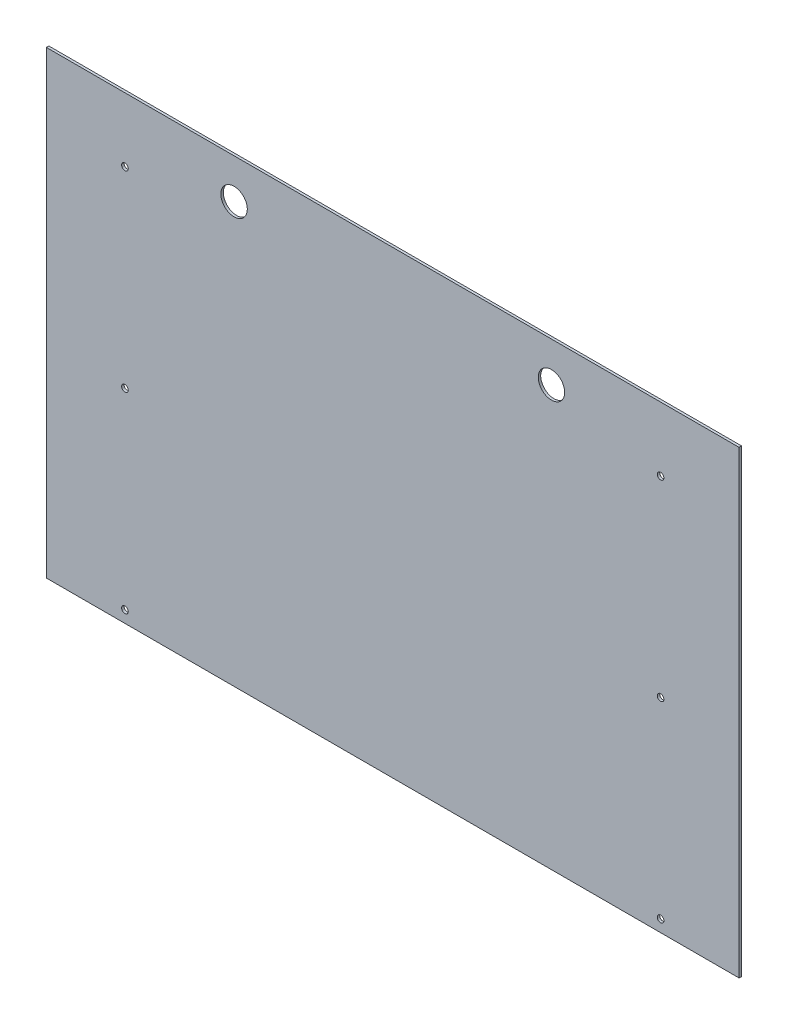
ISO-10303-21;
HEADER;
FILE_DESCRIPTION(('STEP AP214'),'2;1');
FILE_NAME('part.step','',(''),(''),'','','');
FILE_SCHEMA(('AUTOMOTIVE_DESIGN { 1 0 10303 214 1 1 1 1 }'));
ENDSEC;
DATA;
#1=APPLICATION_CONTEXT('core data for automotive mechanical design processes');
#2=APPLICATION_PROTOCOL_DEFINITION('international standard','automotive_design',2000,#1);
#3=PRODUCT_CONTEXT('',#1,'mechanical');
#4=PRODUCT('Part','Part','',(#3));
#5=PRODUCT_RELATED_PRODUCT_CATEGORY('part','',(#4));
#6=PRODUCT_DEFINITION_FORMATION('','',#4);
#7=PRODUCT_DEFINITION_CONTEXT('part definition',#1,'design');
#8=PRODUCT_DEFINITION('design','',#6,#7);
#9=PRODUCT_DEFINITION_SHAPE('','',#8);
#10=(LENGTH_UNIT() NAMED_UNIT(*) SI_UNIT(.MILLI.,.METRE.));
#11=(NAMED_UNIT(*) PLANE_ANGLE_UNIT() SI_UNIT($,.RADIAN.));
#12=(NAMED_UNIT(*) SI_UNIT($,.STERADIAN.) SOLID_ANGLE_UNIT());
#13=UNCERTAINTY_MEASURE_WITH_UNIT(LENGTH_MEASURE(1.E-05),#10,'distance_accuracy_value','');
#14=(GEOMETRIC_REPRESENTATION_CONTEXT(3) GLOBAL_UNCERTAINTY_ASSIGNED_CONTEXT((#13)) GLOBAL_UNIT_ASSIGNED_CONTEXT((#10,
#11,#12)) REPRESENTATION_CONTEXT('',''));
#15=CARTESIAN_POINT('',(0.,0.,0.));
#16=DIRECTION('',(0.,0.,1.));
#17=DIRECTION('',(1.,0.,0.));
#18=AXIS2_PLACEMENT_3D('',#15,#16,#17);
#19=CARTESIAN_POINT('',(-665.162499999999,1079.5,4.7625));
#20=DIRECTION('',(1.,0.,0.));
#21=DIRECTION('',(0.,1.,0.));
#22=AXIS2_PLACEMENT_3D('',#19,#20,#21);
#23=PLANE('',#22);
#24=DIRECTION('',(0.,-1.,0.));
#25=VECTOR('',#24,1.);
#26=CARTESIAN_POINT('',(-665.162499999999,1079.5,0.));
#27=LINE('',#26,#25);
#28=CARTESIAN_POINT('',(-665.162499999999,1079.5,0.));
#29=VERTEX_POINT('',#28);
#30=CARTESIAN_POINT('',(-665.162499999999,196.85,0.));
#31=VERTEX_POINT('',#30);
#32=EDGE_CURVE('E95',#29,#31,#27,.T.);
#33=ORIENTED_EDGE('',*,*,#32,.T.);
#34=DIRECTION('',(0.,0.,-1.));
#35=VECTOR('',#34,1.);
#36=CARTESIAN_POINT('',(-665.162499999999,196.85,4.7625));
#37=LINE('',#36,#35);
#38=CARTESIAN_POINT('',(-665.162499999999,196.85,4.7625));
#39=VERTEX_POINT('',#38);
#40=EDGE_CURVE('E11',#39,#31,#37,.T.);
#41=ORIENTED_EDGE('',*,*,#40,.F.);
#42=DIRECTION('',(0.,-1.,0.));
#43=VECTOR('',#42,1.);
#44=CARTESIAN_POINT('',(-665.162499999999,1079.5,4.7625));
#45=LINE('',#44,#43);
#46=CARTESIAN_POINT('',(-665.162499999999,1079.5,4.7625));
#47=VERTEX_POINT('',#46);
#48=EDGE_CURVE('E83',#47,#39,#45,.T.);
#49=ORIENTED_EDGE('',*,*,#48,.F.);
#50=DIRECTION('',(0.,0.,-1.));
#51=VECTOR('',#50,1.);
#52=CARTESIAN_POINT('',(-665.162499999999,1079.5,4.7625));
#53=LINE('',#52,#51);
#54=EDGE_CURVE('E91',#47,#29,#53,.T.);
#55=ORIENTED_EDGE('',*,*,#54,.T.);
#56=EDGE_LOOP('',(#33,#41,#49,#55));
#57=FACE_BOUND('',#56,.T.);
#58=ADVANCED_FACE('F32',(#57),#23,.F.);
#59=CARTESIAN_POINT('',(-665.162499999999,196.85,4.7625));
#60=DIRECTION('',(0.,1.,0.));
#61=DIRECTION('',(0.,0.,1.));
#62=AXIS2_PLACEMENT_3D('',#59,#60,#61);
#63=PLANE('',#62);
#64=DIRECTION('',(1.,0.,0.));
#65=VECTOR('',#64,1.);
#66=CARTESIAN_POINT('',(-665.162499999999,196.85,0.));
#67=LINE('',#66,#65);
#68=CARTESIAN_POINT('',(665.162499999999,196.85,0.));
#69=VERTEX_POINT('',#68);
#70=EDGE_CURVE('E87',#31,#69,#67,.T.);
#71=ORIENTED_EDGE('',*,*,#70,.T.);
#72=DIRECTION('',(0.,0.,-1.));
#73=VECTOR('',#72,1.);
#74=CARTESIAN_POINT('',(665.162499999999,196.85,4.7625));
#75=LINE('',#74,#73);
#76=CARTESIAN_POINT('',(665.162499999999,196.85,4.7625));
#77=VERTEX_POINT('',#76);
#78=EDGE_CURVE('E40',#77,#69,#75,.T.);
#79=ORIENTED_EDGE('',*,*,#78,.F.);
#80=DIRECTION('',(1.,0.,0.));
#81=VECTOR('',#80,1.);
#82=CARTESIAN_POINT('',(-665.162499999999,196.85,4.7625));
#83=LINE('',#82,#81);
#84=EDGE_CURVE('E78',#39,#77,#83,.T.);
#85=ORIENTED_EDGE('',*,*,#84,.F.);
#86=ORIENTED_EDGE('',*,*,#40,.T.);
#87=EDGE_LOOP('',(#71,#79,#85,#86));
#88=FACE_BOUND('',#87,.T.);
#89=ADVANCED_FACE('F86',(#88),#63,.F.);
#90=CARTESIAN_POINT('',(665.162499999999,1079.5,4.7625));
#91=DIRECTION('',(-1.,0.,0.));
#92=DIRECTION('',(0.,-1.,0.));
#93=AXIS2_PLACEMENT_3D('',#90,#91,#92);
#94=PLANE('',#93);
#95=DIRECTION('',(0.,1.,0.));
#96=VECTOR('',#95,1.);
#97=CARTESIAN_POINT('',(665.162499999999,1079.5,0.));
#98=LINE('',#97,#96);
#99=CARTESIAN_POINT('',(665.162499999999,1079.5,0.));
#100=VERTEX_POINT('',#99);
#101=EDGE_CURVE('E65',#69,#100,#98,.T.);
#102=ORIENTED_EDGE('',*,*,#101,.T.);
#103=DIRECTION('',(0.,0.,-1.));
#104=VECTOR('',#103,1.);
#105=CARTESIAN_POINT('',(665.162499999999,1079.5,4.7625));
#106=LINE('',#105,#104);
#107=CARTESIAN_POINT('',(665.162499999999,1079.5,4.7625));
#108=VERTEX_POINT('',#107);
#109=EDGE_CURVE('E88',#108,#100,#106,.T.);
#110=ORIENTED_EDGE('',*,*,#109,.F.);
#111=DIRECTION('',(0.,1.,0.));
#112=VECTOR('',#111,1.);
#113=CARTESIAN_POINT('',(665.162499999999,1079.5,4.7625));
#114=LINE('',#113,#112);
#115=EDGE_CURVE('E81',#77,#108,#114,.T.);
#116=ORIENTED_EDGE('',*,*,#115,.F.);
#117=ORIENTED_EDGE('',*,*,#78,.T.);
#118=EDGE_LOOP('',(#102,#110,#116,#117));
#119=FACE_BOUND('',#118,.T.);
#120=ADVANCED_FACE('F89',(#119),#94,.F.);
#121=CARTESIAN_POINT('',(-665.162499999999,1079.5,4.7625));
#122=DIRECTION('',(0.,-1.,0.));
#123=DIRECTION('',(0.,0.,-1.));
#124=AXIS2_PLACEMENT_3D('',#121,#122,#123);
#125=PLANE('',#124);
#126=DIRECTION('',(-1.,0.,0.));
#127=VECTOR('',#126,1.);
#128=CARTESIAN_POINT('',(-665.162499999999,1079.5,0.));
#129=LINE('',#128,#127);
#130=EDGE_CURVE('E71',#100,#29,#129,.T.);
#131=ORIENTED_EDGE('',*,*,#130,.T.);
#132=ORIENTED_EDGE('',*,*,#54,.F.);
#133=DIRECTION('',(-1.,0.,0.));
#134=VECTOR('',#133,1.);
#135=CARTESIAN_POINT('',(-665.162499999999,1079.5,4.7625));
#136=LINE('',#135,#134);
#137=EDGE_CURVE('E48',#108,#47,#136,.T.);
#138=ORIENTED_EDGE('',*,*,#137,.F.);
#139=ORIENTED_EDGE('',*,*,#109,.T.);
#140=EDGE_LOOP('',(#131,#132,#138,#139));
#141=FACE_BOUND('',#140,.T.);
#142=ADVANCED_FACE('F103',(#141),#125,.F.);
#143=CARTESIAN_POINT('',(-665.162499999999,196.85,4.7625));
#144=DIRECTION('',(0.,0.,1.));
#145=DIRECTION('',(1.,0.,0.));
#146=AXIS2_PLACEMENT_3D('',#143,#144,#145);
#147=PLANE('',#146);
#148=CARTESIAN_POINT('',(-304.8,1003.3,4.7625));
#149=DIRECTION('',(0.,0.,1.));
#150=DIRECTION('',(-1.,0.,0.));
#151=AXIS2_PLACEMENT_3D('',#148,#149,#150);
#152=CIRCLE('',#151,25.4);
#153=CARTESIAN_POINT('',(-330.2,1003.3,4.7625));
#154=VERTEX_POINT('',#153);
#155=EDGE_CURVE('E151',#154,#154,#152,.T.);
#156=ORIENTED_EDGE('',*,*,#155,.F.);
#157=EDGE_LOOP('',(#156));
#158=FACE_BOUND('',#157,.T.);
#159=CARTESIAN_POINT('',(304.8,1003.3,4.7625));
#160=DIRECTION('',(0.,0.,1.));
#161=DIRECTION('',(1.,0.,0.));
#162=AXIS2_PLACEMENT_3D('',#159,#160,#161);
#163=CIRCLE('',#162,25.4);
#164=CARTESIAN_POINT('',(330.2,1003.3,4.7625));
#165=VERTEX_POINT('',#164);
#166=EDGE_CURVE('E145',#165,#165,#163,.T.);
#167=ORIENTED_EDGE('',*,*,#166,.F.);
#168=EDGE_LOOP('',(#167));
#169=FACE_BOUND('',#168,.T.);
#170=CARTESIAN_POINT('',(-514.35,956.31,4.7625));
#171=DIRECTION('',(0.,0.,1.));
#172=DIRECTION('',(-1.,0.,0.));
#173=AXIS2_PLACEMENT_3D('',#170,#171,#172);
#174=CIRCLE('',#173,6.34999999999994);
#175=CARTESIAN_POINT('',(-520.7,956.31,4.7625));
#176=VERTEX_POINT('',#175);
#177=EDGE_CURVE('E139',#176,#176,#174,.T.);
#178=ORIENTED_EDGE('',*,*,#177,.F.);
#179=EDGE_LOOP('',(#178));
#180=FACE_BOUND('',#179,.T.);
#181=CARTESIAN_POINT('',(-514.35,588.01,4.7625));
#182=DIRECTION('',(0.,0.,1.));
#183=DIRECTION('',(-1.,0.,0.));
#184=AXIS2_PLACEMENT_3D('',#181,#182,#183);
#185=CIRCLE('',#184,6.34999999999994);
#186=CARTESIAN_POINT('',(-520.7,588.01,4.7625));
#187=VERTEX_POINT('',#186);
#188=EDGE_CURVE('E133',#187,#187,#185,.T.);
#189=ORIENTED_EDGE('',*,*,#188,.F.);
#190=EDGE_LOOP('',(#189));
#191=FACE_BOUND('',#190,.T.);
#192=CARTESIAN_POINT('',(-514.35,219.71,4.7625));
#193=DIRECTION('',(0.,0.,1.));
#194=DIRECTION('',(-1.,0.,0.));
#195=AXIS2_PLACEMENT_3D('',#192,#193,#194);
#196=CIRCLE('',#195,6.34999999999994);
#197=CARTESIAN_POINT('',(-520.7,219.71,4.7625));
#198=VERTEX_POINT('',#197);
#199=EDGE_CURVE('E127',#198,#198,#196,.T.);
#200=ORIENTED_EDGE('',*,*,#199,.F.);
#201=EDGE_LOOP('',(#200));
#202=FACE_BOUND('',#201,.T.);
#203=CARTESIAN_POINT('',(514.35,219.71,4.7625));
#204=DIRECTION('',(0.,0.,1.));
#205=DIRECTION('',(1.,0.,0.));
#206=AXIS2_PLACEMENT_3D('',#203,#204,#205);
#207=CIRCLE('',#206,6.34999999999994);
#208=CARTESIAN_POINT('',(520.7,219.71,4.7625));
#209=VERTEX_POINT('',#208);
#210=EDGE_CURVE('E121',#209,#209,#207,.T.);
#211=ORIENTED_EDGE('',*,*,#210,.F.);
#212=EDGE_LOOP('',(#211));
#213=FACE_BOUND('',#212,.T.);
#214=CARTESIAN_POINT('',(514.35,588.01,4.7625));
#215=DIRECTION('',(0.,0.,1.));
#216=DIRECTION('',(1.,0.,0.));
#217=AXIS2_PLACEMENT_3D('',#214,#215,#216);
#218=CIRCLE('',#217,6.34999999999994);
#219=CARTESIAN_POINT('',(520.7,588.01,4.7625));
#220=VERTEX_POINT('',#219);
#221=EDGE_CURVE('E115',#220,#220,#218,.T.);
#222=ORIENTED_EDGE('',*,*,#221,.F.);
#223=EDGE_LOOP('',(#222));
#224=FACE_BOUND('',#223,.T.);
#225=CARTESIAN_POINT('',(514.35,956.31,4.7625));
#226=DIRECTION('',(0.,0.,1.));
#227=DIRECTION('',(1.,0.,0.));
#228=AXIS2_PLACEMENT_3D('',#225,#226,#227);
#229=CIRCLE('',#228,6.34999999999994);
#230=CARTESIAN_POINT('',(520.7,956.31,4.7625));
#231=VERTEX_POINT('',#230);
#232=EDGE_CURVE('E109',#231,#231,#229,.T.);
#233=ORIENTED_EDGE('',*,*,#232,.F.);
#234=EDGE_LOOP('',(#233));
#235=FACE_BOUND('',#234,.T.);
#236=ORIENTED_EDGE('',*,*,#48,.T.);
#237=ORIENTED_EDGE('',*,*,#84,.T.);
#238=ORIENTED_EDGE('',*,*,#115,.T.);
#239=ORIENTED_EDGE('',*,*,#137,.T.);
#240=EDGE_LOOP('',(#236,#237,#238,#239));
#241=FACE_BOUND('',#240,.T.);
#242=ADVANCED_FACE('F79',(#158,#169,#180,#191,#202,#213,#224,#235,#241),#147,.T.);
#243=CARTESIAN_POINT('',(-665.162499999999,196.85,0.));
#244=DIRECTION('',(0.,0.,1.));
#245=DIRECTION('',(1.,0.,0.));
#246=AXIS2_PLACEMENT_3D('',#243,#244,#245);
#247=PLANE('',#246);
#248=CARTESIAN_POINT('',(-304.8,1003.3,0.));
#249=DIRECTION('',(0.,0.,1.));
#250=DIRECTION('',(-1.,0.,0.));
#251=AXIS2_PLACEMENT_3D('',#248,#249,#250);
#252=CIRCLE('',#251,25.4);
#253=CARTESIAN_POINT('',(-330.2,1003.3,0.));
#254=VERTEX_POINT('',#253);
#255=EDGE_CURVE('E148',#254,#254,#252,.T.);
#256=ORIENTED_EDGE('',*,*,#255,.T.);
#257=EDGE_LOOP('',(#256));
#258=FACE_BOUND('',#257,.T.);
#259=CARTESIAN_POINT('',(304.8,1003.3,0.));
#260=DIRECTION('',(0.,0.,1.));
#261=DIRECTION('',(1.,0.,0.));
#262=AXIS2_PLACEMENT_3D('',#259,#260,#261);
#263=CIRCLE('',#262,25.4);
#264=CARTESIAN_POINT('',(330.2,1003.3,0.));
#265=VERTEX_POINT('',#264);
#266=EDGE_CURVE('E142',#265,#265,#263,.T.);
#267=ORIENTED_EDGE('',*,*,#266,.T.);
#268=EDGE_LOOP('',(#267));
#269=FACE_BOUND('',#268,.T.);
#270=CARTESIAN_POINT('',(-514.35,956.31,0.));
#271=DIRECTION('',(0.,0.,1.));
#272=DIRECTION('',(-1.,0.,0.));
#273=AXIS2_PLACEMENT_3D('',#270,#271,#272);
#274=CIRCLE('',#273,6.34999999999994);
#275=CARTESIAN_POINT('',(-520.7,956.31,0.));
#276=VERTEX_POINT('',#275);
#277=EDGE_CURVE('E136',#276,#276,#274,.T.);
#278=ORIENTED_EDGE('',*,*,#277,.T.);
#279=EDGE_LOOP('',(#278));
#280=FACE_BOUND('',#279,.T.);
#281=CARTESIAN_POINT('',(-514.35,588.01,0.));
#282=DIRECTION('',(0.,0.,1.));
#283=DIRECTION('',(-1.,0.,0.));
#284=AXIS2_PLACEMENT_3D('',#281,#282,#283);
#285=CIRCLE('',#284,6.34999999999994);
#286=CARTESIAN_POINT('',(-520.7,588.01,0.));
#287=VERTEX_POINT('',#286);
#288=EDGE_CURVE('E130',#287,#287,#285,.T.);
#289=ORIENTED_EDGE('',*,*,#288,.T.);
#290=EDGE_LOOP('',(#289));
#291=FACE_BOUND('',#290,.T.);
#292=CARTESIAN_POINT('',(-514.35,219.71,0.));
#293=DIRECTION('',(0.,0.,1.));
#294=DIRECTION('',(-1.,0.,0.));
#295=AXIS2_PLACEMENT_3D('',#292,#293,#294);
#296=CIRCLE('',#295,6.34999999999994);
#297=CARTESIAN_POINT('',(-520.7,219.71,0.));
#298=VERTEX_POINT('',#297);
#299=EDGE_CURVE('E124',#298,#298,#296,.T.);
#300=ORIENTED_EDGE('',*,*,#299,.T.);
#301=EDGE_LOOP('',(#300));
#302=FACE_BOUND('',#301,.T.);
#303=CARTESIAN_POINT('',(514.35,219.71,0.));
#304=DIRECTION('',(0.,0.,1.));
#305=DIRECTION('',(1.,0.,0.));
#306=AXIS2_PLACEMENT_3D('',#303,#304,#305);
#307=CIRCLE('',#306,6.34999999999994);
#308=CARTESIAN_POINT('',(520.7,219.71,0.));
#309=VERTEX_POINT('',#308);
#310=EDGE_CURVE('E118',#309,#309,#307,.T.);
#311=ORIENTED_EDGE('',*,*,#310,.T.);
#312=EDGE_LOOP('',(#311));
#313=FACE_BOUND('',#312,.T.);
#314=CARTESIAN_POINT('',(514.35,588.01,0.));
#315=DIRECTION('',(0.,0.,1.));
#316=DIRECTION('',(1.,0.,0.));
#317=AXIS2_PLACEMENT_3D('',#314,#315,#316);
#318=CIRCLE('',#317,6.34999999999994);
#319=CARTESIAN_POINT('',(520.7,588.01,0.));
#320=VERTEX_POINT('',#319);
#321=EDGE_CURVE('E112',#320,#320,#318,.T.);
#322=ORIENTED_EDGE('',*,*,#321,.T.);
#323=EDGE_LOOP('',(#322));
#324=FACE_BOUND('',#323,.T.);
#325=CARTESIAN_POINT('',(514.35,956.31,0.));
#326=DIRECTION('',(0.,0.,1.));
#327=DIRECTION('',(1.,0.,0.));
#328=AXIS2_PLACEMENT_3D('',#325,#326,#327);
#329=CIRCLE('',#328,6.34999999999994);
#330=CARTESIAN_POINT('',(520.7,956.31,0.));
#331=VERTEX_POINT('',#330);
#332=EDGE_CURVE('E98',#331,#331,#329,.T.);
#333=ORIENTED_EDGE('',*,*,#332,.T.);
#334=EDGE_LOOP('',(#333));
#335=FACE_BOUND('',#334,.T.);
#336=ORIENTED_EDGE('',*,*,#32,.F.);
#337=ORIENTED_EDGE('',*,*,#130,.F.);
#338=ORIENTED_EDGE('',*,*,#101,.F.);
#339=ORIENTED_EDGE('',*,*,#70,.F.);
#340=EDGE_LOOP('',(#336,#337,#338,#339));
#341=FACE_BOUND('',#340,.T.);
#342=ADVANCED_FACE('F106',(#258,#269,#280,#291,#302,#313,#324,#335,#341),#247,.F.);
#343=CARTESIAN_POINT('',(514.35,956.31,0.));
#344=DIRECTION('',(0.,0.,1.));
#345=DIRECTION('',(1.,0.,0.));
#346=AXIS2_PLACEMENT_3D('',#343,#344,#345);
#347=CYLINDRICAL_SURFACE('',#346,6.34999999999994);
#348=ORIENTED_EDGE('',*,*,#332,.F.);
#349=EDGE_LOOP('',(#348));
#350=FACE_BOUND('',#349,.T.);
#351=ORIENTED_EDGE('',*,*,#232,.T.);
#352=EDGE_LOOP('',(#351));
#353=FACE_BOUND('',#352,.T.);
#354=ADVANCED_FACE('F183',(#350,#353),#347,.F.);
#355=CARTESIAN_POINT('',(514.35,588.01,0.));
#356=DIRECTION('',(0.,0.,1.));
#357=DIRECTION('',(1.,0.,0.));
#358=AXIS2_PLACEMENT_3D('',#355,#356,#357);
#359=CYLINDRICAL_SURFACE('',#358,6.34999999999994);
#360=ORIENTED_EDGE('',*,*,#321,.F.);
#361=EDGE_LOOP('',(#360));
#362=FACE_BOUND('',#361,.T.);
#363=ORIENTED_EDGE('',*,*,#221,.T.);
#364=EDGE_LOOP('',(#363));
#365=FACE_BOUND('',#364,.T.);
#366=ADVANCED_FACE('F185',(#362,#365),#359,.F.);
#367=CARTESIAN_POINT('',(514.35,219.71,0.));
#368=DIRECTION('',(0.,0.,1.));
#369=DIRECTION('',(1.,0.,0.));
#370=AXIS2_PLACEMENT_3D('',#367,#368,#369);
#371=CYLINDRICAL_SURFACE('',#370,6.34999999999994);
#372=ORIENTED_EDGE('',*,*,#310,.F.);
#373=EDGE_LOOP('',(#372));
#374=FACE_BOUND('',#373,.T.);
#375=ORIENTED_EDGE('',*,*,#210,.T.);
#376=EDGE_LOOP('',(#375));
#377=FACE_BOUND('',#376,.T.);
#378=ADVANCED_FACE('F192',(#374,#377),#371,.F.);
#379=CARTESIAN_POINT('',(-514.35,219.71,0.));
#380=DIRECTION('',(0.,0.,1.));
#381=DIRECTION('',(1.,0.,0.));
#382=AXIS2_PLACEMENT_3D('',#379,#380,#381);
#383=CYLINDRICAL_SURFACE('',#382,6.34999999999994);
#384=ORIENTED_EDGE('',*,*,#299,.F.);
#385=EDGE_LOOP('',(#384));
#386=FACE_BOUND('',#385,.T.);
#387=ORIENTED_EDGE('',*,*,#199,.T.);
#388=EDGE_LOOP('',(#387));
#389=FACE_BOUND('',#388,.T.);
#390=ADVANCED_FACE('F252',(#386,#389),#383,.F.);
#391=CARTESIAN_POINT('',(-514.35,588.01,0.));
#392=DIRECTION('',(0.,0.,1.));
#393=DIRECTION('',(1.,0.,0.));
#394=AXIS2_PLACEMENT_3D('',#391,#392,#393);
#395=CYLINDRICAL_SURFACE('',#394,6.34999999999994);
#396=ORIENTED_EDGE('',*,*,#288,.F.);
#397=EDGE_LOOP('',(#396));
#398=FACE_BOUND('',#397,.T.);
#399=ORIENTED_EDGE('',*,*,#188,.T.);
#400=EDGE_LOOP('',(#399));
#401=FACE_BOUND('',#400,.T.);
#402=ADVANCED_FACE('F245',(#398,#401),#395,.F.);
#403=CARTESIAN_POINT('',(-514.35,956.31,0.));
#404=DIRECTION('',(0.,0.,1.));
#405=DIRECTION('',(1.,0.,0.));
#406=AXIS2_PLACEMENT_3D('',#403,#404,#405);
#407=CYLINDRICAL_SURFACE('',#406,6.34999999999994);
#408=ORIENTED_EDGE('',*,*,#277,.F.);
#409=EDGE_LOOP('',(#408));
#410=FACE_BOUND('',#409,.T.);
#411=ORIENTED_EDGE('',*,*,#177,.T.);
#412=EDGE_LOOP('',(#411));
#413=FACE_BOUND('',#412,.T.);
#414=ADVANCED_FACE('F230',(#410,#413),#407,.F.);
#415=CARTESIAN_POINT('',(304.8,1003.3,0.));
#416=DIRECTION('',(0.,0.,1.));
#417=DIRECTION('',(1.,0.,0.));
#418=AXIS2_PLACEMENT_3D('',#415,#416,#417);
#419=CYLINDRICAL_SURFACE('',#418,25.4);
#420=ORIENTED_EDGE('',*,*,#266,.F.);
#421=EDGE_LOOP('',(#420));
#422=FACE_BOUND('',#421,.T.);
#423=ORIENTED_EDGE('',*,*,#166,.T.);
#424=EDGE_LOOP('',(#423));
#425=FACE_BOUND('',#424,.T.);
#426=ADVANCED_FACE('F162',(#422,#425),#419,.F.);
#427=CARTESIAN_POINT('',(-304.8,1003.3,0.));
#428=DIRECTION('',(0.,0.,1.));
#429=DIRECTION('',(1.,0.,0.));
#430=AXIS2_PLACEMENT_3D('',#427,#428,#429);
#431=CYLINDRICAL_SURFACE('',#430,25.4);
#432=ORIENTED_EDGE('',*,*,#255,.F.);
#433=EDGE_LOOP('',(#432));
#434=FACE_BOUND('',#433,.T.);
#435=ORIENTED_EDGE('',*,*,#155,.T.);
#436=EDGE_LOOP('',(#435));
#437=FACE_BOUND('',#436,.T.);
#438=ADVANCED_FACE('F159',(#434,#437),#431,.F.);
#439=CLOSED_SHELL('',(#58,#89,#120,#142,#242,#342,#354,#366,#378,#390,#402,#414,#426,#438));
#440=MANIFOLD_SOLID_BREP('B2',#439);
#441=ADVANCED_BREP_SHAPE_REPRESENTATION('',(#18,#440),#14);
#442=SHAPE_DEFINITION_REPRESENTATION(#9,#441);
ENDSEC;
END-ISO-10303-21;
